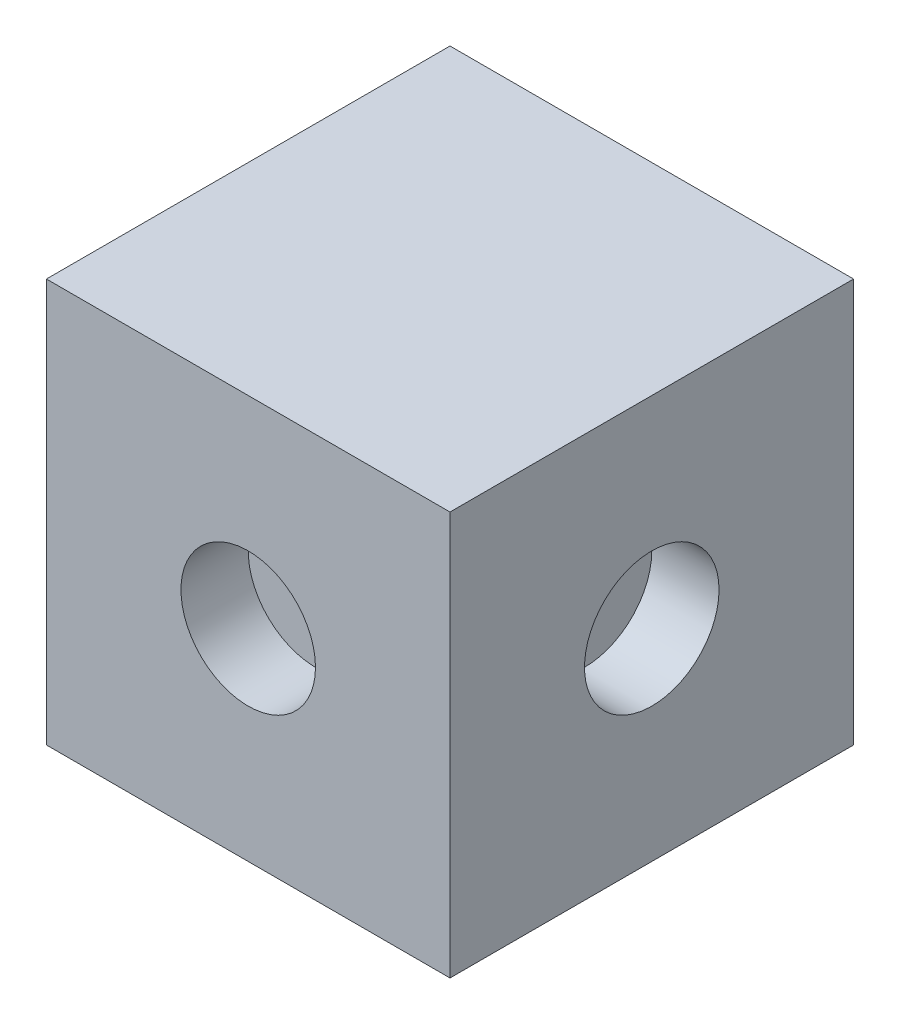
ISO-10303-21;
HEADER;
FILE_DESCRIPTION(('STEP AP214'),'2;1');
FILE_NAME('part.step','',(''),(''),'','','');
FILE_SCHEMA(('AUTOMOTIVE_DESIGN { 1 0 10303 214 1 1 1 1 }'));
ENDSEC;
DATA;
#1=APPLICATION_CONTEXT('core data for automotive mechanical design processes');
#2=APPLICATION_PROTOCOL_DEFINITION('international standard','automotive_design',2000,#1);
#3=PRODUCT_CONTEXT('',#1,'mechanical');
#4=PRODUCT('Part','Part','',(#3));
#5=PRODUCT_RELATED_PRODUCT_CATEGORY('part','',(#4));
#6=PRODUCT_DEFINITION_FORMATION('','',#4);
#7=PRODUCT_DEFINITION_CONTEXT('part definition',#1,'design');
#8=PRODUCT_DEFINITION('design','',#6,#7);
#9=PRODUCT_DEFINITION_SHAPE('','',#8);
#10=(LENGTH_UNIT() NAMED_UNIT(*) SI_UNIT(.MILLI.,.METRE.));
#11=(NAMED_UNIT(*) PLANE_ANGLE_UNIT() SI_UNIT($,.RADIAN.));
#12=(NAMED_UNIT(*) SI_UNIT($,.STERADIAN.) SOLID_ANGLE_UNIT());
#13=UNCERTAINTY_MEASURE_WITH_UNIT(LENGTH_MEASURE(1.E-05),#10,'distance_accuracy_value','');
#14=(GEOMETRIC_REPRESENTATION_CONTEXT(3) GLOBAL_UNCERTAINTY_ASSIGNED_CONTEXT((#13)) GLOBAL_UNIT_ASSIGNED_CONTEXT((#10,
#11,#12)) REPRESENTATION_CONTEXT('',''));
#15=CARTESIAN_POINT('',(0.,0.,0.));
#16=DIRECTION('',(0.,0.,1.));
#17=DIRECTION('',(1.,0.,0.));
#18=AXIS2_PLACEMENT_3D('',#15,#16,#17);
#19=CARTESIAN_POINT('',(6.,12.,6.));
#20=DIRECTION('',(-1.,0.,0.));
#21=DIRECTION('',(0.,0.,1.));
#22=AXIS2_PLACEMENT_3D('',#19,#20,#21);
#23=PLANE('',#22);
#24=CARTESIAN_POINT('',(6.,6.,0.));
#25=DIRECTION('',(1.,0.,0.));
#26=DIRECTION('',(0.,0.,-1.));
#27=AXIS2_PLACEMENT_3D('',#24,#25,#26);
#28=CIRCLE('',#27,2.);
#29=CARTESIAN_POINT('',(6.00000000000002,6.,-1.99999999999994));
#30=VERTEX_POINT('',#29);
#31=EDGE_CURVE('E116',#30,#30,#28,.T.);
#32=ORIENTED_EDGE('',*,*,#31,.F.);
#33=EDGE_LOOP('',(#32));
#34=FACE_BOUND('',#33,.T.);
#35=DIRECTION('',(0.,0.,-1.));
#36=VECTOR('',#35,1.);
#37=CARTESIAN_POINT('',(6.,0.,6.));
#38=LINE('',#37,#36);
#39=CARTESIAN_POINT('',(6.,0.,6.));
#40=VERTEX_POINT('',#39);
#41=CARTESIAN_POINT('',(6.,0.,-6.));
#42=VERTEX_POINT('',#41);
#43=EDGE_CURVE('E96',#40,#42,#38,.T.);
#44=ORIENTED_EDGE('',*,*,#43,.T.);
#45=DIRECTION('',(0.,-1.,0.));
#46=VECTOR('',#45,1.);
#47=CARTESIAN_POINT('',(6.,12.,-6.));
#48=LINE('',#47,#46);
#49=CARTESIAN_POINT('',(6.,12.,-6.));
#50=VERTEX_POINT('',#49);
#51=EDGE_CURVE('E11',#50,#42,#48,.T.);
#52=ORIENTED_EDGE('',*,*,#51,.F.);
#53=DIRECTION('',(0.,0.,-1.));
#54=VECTOR('',#53,1.);
#55=CARTESIAN_POINT('',(6.,12.,6.));
#56=LINE('',#55,#54);
#57=CARTESIAN_POINT('',(6.,12.,6.));
#58=VERTEX_POINT('',#57);
#59=EDGE_CURVE('E84',#58,#50,#56,.T.);
#60=ORIENTED_EDGE('',*,*,#59,.F.);
#61=DIRECTION('',(0.,-1.,0.));
#62=VECTOR('',#61,1.);
#63=CARTESIAN_POINT('',(6.,12.,6.));
#64=LINE('',#63,#62);
#65=EDGE_CURVE('E92',#58,#40,#64,.T.);
#66=ORIENTED_EDGE('',*,*,#65,.T.);
#67=EDGE_LOOP('',(#44,#52,#60,#66));
#68=FACE_BOUND('',#67,.T.);
#69=ADVANCED_FACE('F33',(#34,#68),#23,.F.);
#70=CARTESIAN_POINT('',(-6.,12.,-6.));
#71=DIRECTION('',(0.,0.,1.));
#72=DIRECTION('',(1.,0.,0.));
#73=AXIS2_PLACEMENT_3D('',#70,#71,#72);
#74=PLANE('',#73);
#75=CARTESIAN_POINT('',(0.,6.,-6.));
#76=DIRECTION('',(0.,0.,-1.));
#77=DIRECTION('',(-1.,0.,0.));
#78=AXIS2_PLACEMENT_3D('',#75,#76,#77);
#79=CIRCLE('',#78,2.);
#80=CARTESIAN_POINT('',(-2.,6.,-6.));
#81=VERTEX_POINT('',#80);
#82=EDGE_CURVE('E122',#81,#81,#79,.T.);
#83=ORIENTED_EDGE('',*,*,#82,.F.);
#84=EDGE_LOOP('',(#83));
#85=FACE_BOUND('',#84,.T.);
#86=DIRECTION('',(-1.,0.,0.));
#87=VECTOR('',#86,1.);
#88=CARTESIAN_POINT('',(-6.,0.,-6.));
#89=LINE('',#88,#87);
#90=CARTESIAN_POINT('',(-6.,0.,-6.));
#91=VERTEX_POINT('',#90);
#92=EDGE_CURVE('E88',#42,#91,#89,.T.);
#93=ORIENTED_EDGE('',*,*,#92,.T.);
#94=DIRECTION('',(0.,-1.,0.));
#95=VECTOR('',#94,1.);
#96=CARTESIAN_POINT('',(-6.,12.,-6.));
#97=LINE('',#96,#95);
#98=CARTESIAN_POINT('',(-6.,12.,-6.));
#99=VERTEX_POINT('',#98);
#100=EDGE_CURVE('E41',#99,#91,#97,.T.);
#101=ORIENTED_EDGE('',*,*,#100,.F.);
#102=DIRECTION('',(-1.,0.,0.));
#103=VECTOR('',#102,1.);
#104=CARTESIAN_POINT('',(-6.,12.,-6.));
#105=LINE('',#104,#103);
#106=EDGE_CURVE('E79',#50,#99,#105,.T.);
#107=ORIENTED_EDGE('',*,*,#106,.F.);
#108=ORIENTED_EDGE('',*,*,#51,.T.);
#109=EDGE_LOOP('',(#93,#101,#107,#108));
#110=FACE_BOUND('',#109,.T.);
#111=ADVANCED_FACE('F87',(#85,#110),#74,.F.);
#112=CARTESIAN_POINT('',(-6.,12.,6.));
#113=DIRECTION('',(1.,0.,0.));
#114=DIRECTION('',(0.,0.,-1.));
#115=AXIS2_PLACEMENT_3D('',#112,#113,#114);
#116=PLANE('',#115);
#117=CARTESIAN_POINT('',(-6.,6.,0.));
#118=DIRECTION('',(-1.,0.,0.));
#119=DIRECTION('',(0.,0.,1.));
#120=AXIS2_PLACEMENT_3D('',#117,#118,#119);
#121=CIRCLE('',#120,2.);
#122=CARTESIAN_POINT('',(-6.00000000000001,6.,1.99999999999998));
#123=VERTEX_POINT('',#122);
#124=EDGE_CURVE('E128',#123,#123,#121,.T.);
#125=ORIENTED_EDGE('',*,*,#124,.F.);
#126=EDGE_LOOP('',(#125));
#127=FACE_BOUND('',#126,.T.);
#128=DIRECTION('',(0.,0.,1.));
#129=VECTOR('',#128,1.);
#130=CARTESIAN_POINT('',(-6.,0.,6.));
#131=LINE('',#130,#129);
#132=CARTESIAN_POINT('',(-6.,0.,6.));
#133=VERTEX_POINT('',#132);
#134=EDGE_CURVE('E66',#91,#133,#131,.T.);
#135=ORIENTED_EDGE('',*,*,#134,.T.);
#136=DIRECTION('',(0.,-1.,0.));
#137=VECTOR('',#136,1.);
#138=CARTESIAN_POINT('',(-6.,12.,6.));
#139=LINE('',#138,#137);
#140=CARTESIAN_POINT('',(-6.,12.,6.));
#141=VERTEX_POINT('',#140);
#142=EDGE_CURVE('E89',#141,#133,#139,.T.);
#143=ORIENTED_EDGE('',*,*,#142,.F.);
#144=DIRECTION('',(0.,0.,1.));
#145=VECTOR('',#144,1.);
#146=CARTESIAN_POINT('',(-6.,12.,6.));
#147=LINE('',#146,#145);
#148=EDGE_CURVE('E82',#99,#141,#147,.T.);
#149=ORIENTED_EDGE('',*,*,#148,.F.);
#150=ORIENTED_EDGE('',*,*,#100,.T.);
#151=EDGE_LOOP('',(#135,#143,#149,#150));
#152=FACE_BOUND('',#151,.T.);
#153=ADVANCED_FACE('F90',(#127,#152),#116,.F.);
#154=CARTESIAN_POINT('',(-6.,12.,6.));
#155=DIRECTION('',(0.,0.,-1.));
#156=DIRECTION('',(-1.,0.,0.));
#157=AXIS2_PLACEMENT_3D('',#154,#155,#156);
#158=PLANE('',#157);
#159=CARTESIAN_POINT('',(0.,6.,6.));
#160=DIRECTION('',(0.,0.,1.));
#161=DIRECTION('',(1.,0.,0.));
#162=AXIS2_PLACEMENT_3D('',#159,#160,#161);
#163=CIRCLE('',#162,2.);
#164=CARTESIAN_POINT('',(2.,6.,6.));
#165=VERTEX_POINT('',#164);
#166=EDGE_CURVE('E110',#165,#165,#163,.T.);
#167=ORIENTED_EDGE('',*,*,#166,.F.);
#168=EDGE_LOOP('',(#167));
#169=FACE_BOUND('',#168,.T.);
#170=DIRECTION('',(1.,0.,0.));
#171=VECTOR('',#170,1.);
#172=CARTESIAN_POINT('',(-6.,0.,6.));
#173=LINE('',#172,#171);
#174=EDGE_CURVE('E72',#133,#40,#173,.T.);
#175=ORIENTED_EDGE('',*,*,#174,.T.);
#176=ORIENTED_EDGE('',*,*,#65,.F.);
#177=DIRECTION('',(1.,0.,0.));
#178=VECTOR('',#177,1.);
#179=CARTESIAN_POINT('',(-6.,12.,6.));
#180=LINE('',#179,#178);
#181=EDGE_CURVE('E49',#141,#58,#180,.T.);
#182=ORIENTED_EDGE('',*,*,#181,.F.);
#183=ORIENTED_EDGE('',*,*,#142,.T.);
#184=EDGE_LOOP('',(#175,#176,#182,#183));
#185=FACE_BOUND('',#184,.T.);
#186=ADVANCED_FACE('F104',(#169,#185),#158,.F.);
#187=CARTESIAN_POINT('',(0.,12.,0.));
#188=DIRECTION('',(0.,-1.,0.));
#189=DIRECTION('',(0.,0.,-1.));
#190=AXIS2_PLACEMENT_3D('',#187,#188,#189);
#191=PLANE('',#190);
#192=ORIENTED_EDGE('',*,*,#59,.T.);
#193=ORIENTED_EDGE('',*,*,#106,.T.);
#194=ORIENTED_EDGE('',*,*,#148,.T.);
#195=ORIENTED_EDGE('',*,*,#181,.T.);
#196=EDGE_LOOP('',(#192,#193,#194,#195));
#197=FACE_BOUND('',#196,.T.);
#198=ADVANCED_FACE('F80',(#197),#191,.F.);
#199=CARTESIAN_POINT('',(0.,0.,0.));
#200=DIRECTION('',(0.,-1.,0.));
#201=DIRECTION('',(0.,0.,-1.));
#202=AXIS2_PLACEMENT_3D('',#199,#200,#201);
#203=PLANE('',#202);
#204=ORIENTED_EDGE('',*,*,#43,.F.);
#205=ORIENTED_EDGE('',*,*,#174,.F.);
#206=ORIENTED_EDGE('',*,*,#134,.F.);
#207=ORIENTED_EDGE('',*,*,#92,.F.);
#208=EDGE_LOOP('',(#204,#205,#206,#207));
#209=FACE_BOUND('',#208,.T.);
#210=ADVANCED_FACE('F107',(#209),#203,.T.);
#211=CARTESIAN_POINT('',(0.,6.,4.));
#212=DIRECTION('',(0.,0.,1.));
#213=DIRECTION('',(1.,0.,0.));
#214=AXIS2_PLACEMENT_3D('',#211,#212,#213);
#215=CYLINDRICAL_SURFACE('',#214,2.);
#216=CARTESIAN_POINT('',(0.,6.,4.));
#217=DIRECTION('',(0.,0.,1.));
#218=DIRECTION('',(1.,0.,0.));
#219=AXIS2_PLACEMENT_3D('',#216,#217,#218);
#220=CIRCLE('',#219,2.);
#221=CARTESIAN_POINT('',(2.,6.,4.));
#222=VERTEX_POINT('',#221);
#223=EDGE_CURVE('E99',#222,#222,#220,.T.);
#224=ORIENTED_EDGE('',*,*,#223,.F.);
#225=EDGE_LOOP('',(#224));
#226=FACE_BOUND('',#225,.T.);
#227=ORIENTED_EDGE('',*,*,#166,.T.);
#228=EDGE_LOOP('',(#227));
#229=FACE_BOUND('',#228,.T.);
#230=ADVANCED_FACE('F178',(#226,#229),#215,.F.);
#231=CARTESIAN_POINT('',(0.,6.,4.));
#232=DIRECTION('',(0.,0.,1.));
#233=DIRECTION('',(1.,0.,0.));
#234=AXIS2_PLACEMENT_3D('',#231,#232,#233);
#235=PLANE('',#234);
#236=ORIENTED_EDGE('',*,*,#223,.T.);
#237=EDGE_LOOP('',(#236));
#238=FACE_BOUND('',#237,.T.);
#239=ADVANCED_FACE('F139',(#238),#235,.T.);
#240=CARTESIAN_POINT('',(-4.,6.,0.));
#241=DIRECTION('',(-1.,0.,0.));
#242=DIRECTION('',(0.,0.,1.));
#243=AXIS2_PLACEMENT_3D('',#240,#241,#242);
#244=CYLINDRICAL_SURFACE('',#243,2.);
#245=CARTESIAN_POINT('',(-4.,6.,0.));
#246=DIRECTION('',(-1.,0.,0.));
#247=DIRECTION('',(0.,0.,1.));
#248=AXIS2_PLACEMENT_3D('',#245,#246,#247);
#249=CIRCLE('',#248,2.);
#250=CARTESIAN_POINT('',(-4.00000000000001,6.,1.99999999999999));
#251=VERTEX_POINT('',#250);
#252=EDGE_CURVE('E113',#251,#251,#249,.T.);
#253=ORIENTED_EDGE('',*,*,#252,.F.);
#254=EDGE_LOOP('',(#253));
#255=FACE_BOUND('',#254,.T.);
#256=ORIENTED_EDGE('',*,*,#124,.T.);
#257=EDGE_LOOP('',(#256));
#258=FACE_BOUND('',#257,.T.);
#259=ADVANCED_FACE('F136',(#255,#258),#244,.F.);
#260=CARTESIAN_POINT('',(-4.,6.,0.));
#261=DIRECTION('',(-1.,0.,0.));
#262=DIRECTION('',(0.,0.,1.));
#263=AXIS2_PLACEMENT_3D('',#260,#261,#262);
#264=PLANE('',#263);
#265=ORIENTED_EDGE('',*,*,#252,.T.);
#266=EDGE_LOOP('',(#265));
#267=FACE_BOUND('',#266,.T.);
#268=ADVANCED_FACE('F134',(#267),#264,.T.);
#269=CARTESIAN_POINT('',(0.,6.,-4.));
#270=DIRECTION('',(0.,0.,-1.));
#271=DIRECTION('',(-1.,0.,0.));
#272=AXIS2_PLACEMENT_3D('',#269,#270,#271);
#273=CYLINDRICAL_SURFACE('',#272,2.);
#274=CARTESIAN_POINT('',(0.,6.,-4.));
#275=DIRECTION('',(0.,0.,-1.));
#276=DIRECTION('',(-1.,0.,0.));
#277=AXIS2_PLACEMENT_3D('',#274,#275,#276);
#278=CIRCLE('',#277,2.);
#279=CARTESIAN_POINT('',(-2.,6.,-4.));
#280=VERTEX_POINT('',#279);
#281=EDGE_CURVE('E125',#280,#280,#278,.T.);
#282=ORIENTED_EDGE('',*,*,#281,.F.);
#283=EDGE_LOOP('',(#282));
#284=FACE_BOUND('',#283,.T.);
#285=ORIENTED_EDGE('',*,*,#82,.T.);
#286=EDGE_LOOP('',(#285));
#287=FACE_BOUND('',#286,.T.);
#288=ADVANCED_FACE('F170',(#284,#287),#273,.F.);
#289=CARTESIAN_POINT('',(0.,6.,-4.));
#290=DIRECTION('',(0.,0.,-1.));
#291=DIRECTION('',(-1.,0.,0.));
#292=AXIS2_PLACEMENT_3D('',#289,#290,#291);
#293=PLANE('',#292);
#294=ORIENTED_EDGE('',*,*,#281,.T.);
#295=EDGE_LOOP('',(#294));
#296=FACE_BOUND('',#295,.T.);
#297=ADVANCED_FACE('F161',(#296),#293,.T.);
#298=CARTESIAN_POINT('',(4.,6.,0.));
#299=DIRECTION('',(1.,0.,0.));
#300=DIRECTION('',(0.,0.,-1.));
#301=AXIS2_PLACEMENT_3D('',#298,#299,#300);
#302=CYLINDRICAL_SURFACE('',#301,2.);
#303=CARTESIAN_POINT('',(4.,6.,0.));
#304=DIRECTION('',(1.,0.,0.));
#305=DIRECTION('',(0.,0.,-1.));
#306=AXIS2_PLACEMENT_3D('',#303,#304,#305);
#307=CIRCLE('',#306,2.);
#308=CARTESIAN_POINT('',(4.00000000000002,6.,-1.99999999999996));
#309=VERTEX_POINT('',#308);
#310=EDGE_CURVE('E119',#309,#309,#307,.T.);
#311=ORIENTED_EDGE('',*,*,#310,.F.);
#312=EDGE_LOOP('',(#311));
#313=FACE_BOUND('',#312,.T.);
#314=ORIENTED_EDGE('',*,*,#31,.T.);
#315=EDGE_LOOP('',(#314));
#316=FACE_BOUND('',#315,.T.);
#317=ADVANCED_FACE('F158',(#313,#316),#302,.F.);
#318=CARTESIAN_POINT('',(4.,6.,0.));
#319=DIRECTION('',(1.,0.,0.));
#320=DIRECTION('',(0.,0.,-1.));
#321=AXIS2_PLACEMENT_3D('',#318,#319,#320);
#322=PLANE('',#321);
#323=ORIENTED_EDGE('',*,*,#310,.T.);
#324=EDGE_LOOP('',(#323));
#325=FACE_BOUND('',#324,.T.);
#326=ADVANCED_FACE('F160',(#325),#322,.T.);
#327=CLOSED_SHELL('',(#69,#111,#153,#186,#198,#210,#230,#239,#259,#268,#288,#297,#317,#326));
#328=MANIFOLD_SOLID_BREP('B2',#327);
#329=ADVANCED_BREP_SHAPE_REPRESENTATION('',(#18,#328),#14);
#330=SHAPE_DEFINITION_REPRESENTATION(#9,#329);
ENDSEC;
END-ISO-10303-21;
